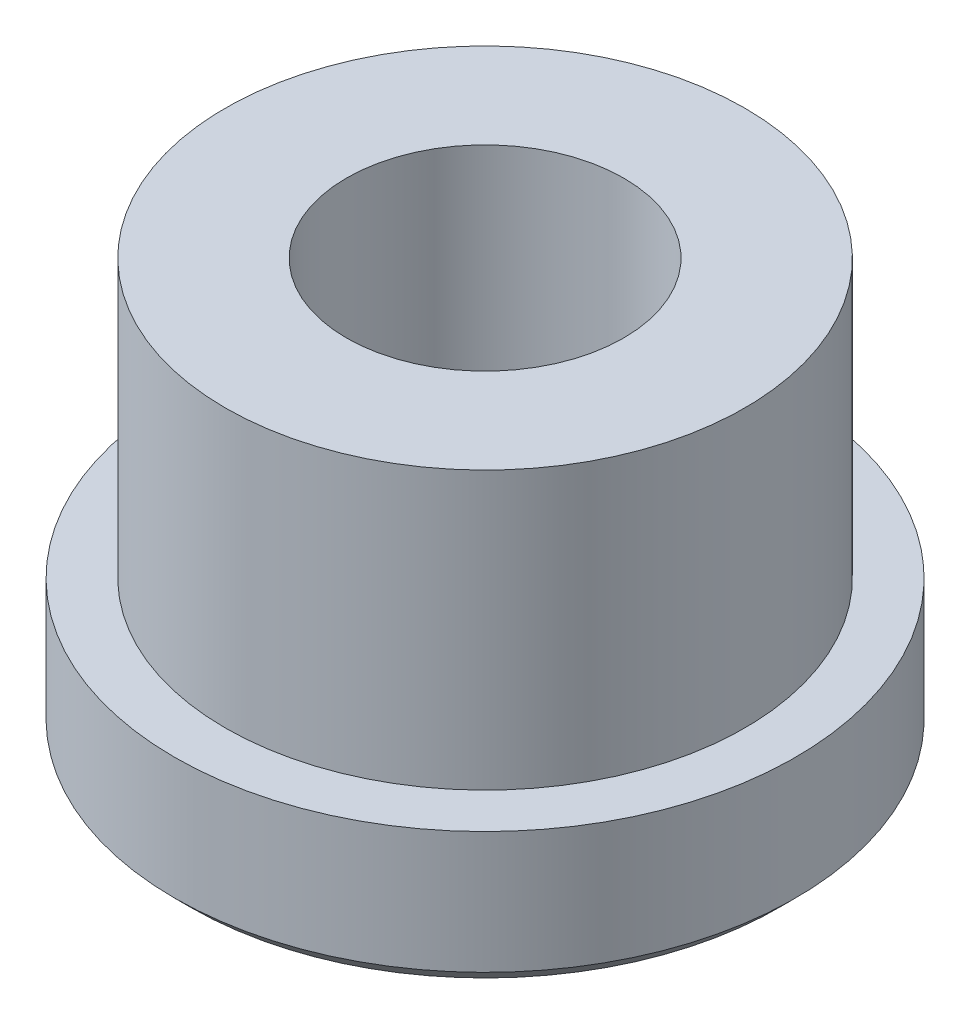
ISO-10303-21;
HEADER;
FILE_DESCRIPTION(('STEP AP214'),'2;1');
FILE_NAME('part.step','',(''),(''),'','','');
FILE_SCHEMA(('AUTOMOTIVE_DESIGN { 1 0 10303 214 1 1 1 1 }'));
ENDSEC;
DATA;
#1=APPLICATION_CONTEXT('core data for automotive mechanical design processes');
#2=APPLICATION_PROTOCOL_DEFINITION('international standard','automotive_design',2000,#1);
#3=PRODUCT_CONTEXT('',#1,'mechanical');
#4=PRODUCT('Part','Part','',(#3));
#5=PRODUCT_RELATED_PRODUCT_CATEGORY('part','',(#4));
#6=PRODUCT_DEFINITION_FORMATION('','',#4);
#7=PRODUCT_DEFINITION_CONTEXT('part definition',#1,'design');
#8=PRODUCT_DEFINITION('design','',#6,#7);
#9=PRODUCT_DEFINITION_SHAPE('','',#8);
#10=(LENGTH_UNIT() NAMED_UNIT(*) SI_UNIT(.MILLI.,.METRE.));
#11=(NAMED_UNIT(*) PLANE_ANGLE_UNIT() SI_UNIT($,.RADIAN.));
#12=(NAMED_UNIT(*) SI_UNIT($,.STERADIAN.) SOLID_ANGLE_UNIT());
#13=UNCERTAINTY_MEASURE_WITH_UNIT(LENGTH_MEASURE(1.E-05),#10,'distance_accuracy_value','');
#14=(GEOMETRIC_REPRESENTATION_CONTEXT(3) GLOBAL_UNCERTAINTY_ASSIGNED_CONTEXT((#13)) GLOBAL_UNIT_ASSIGNED_CONTEXT((#10,
#11,#12)) REPRESENTATION_CONTEXT('',''));
#15=CARTESIAN_POINT('',(0.,0.,0.));
#16=DIRECTION('',(0.,0.,1.));
#17=DIRECTION('',(1.,0.,0.));
#18=AXIS2_PLACEMENT_3D('',#15,#16,#17);
#19=CARTESIAN_POINT('',(6.35,0.,0.));
#20=DIRECTION('',(0.,1.,0.));
#21=DIRECTION('',(0.,0.,1.));
#22=AXIS2_PLACEMENT_3D('',#19,#20,#21);
#23=PLANE('',#22);
#24=CARTESIAN_POINT('',(0.,0.,0.));
#25=DIRECTION('',(0.,1.,0.));
#26=DIRECTION('',(0.,0.,1.));
#27=AXIS2_PLACEMENT_3D('',#24,#25,#26);
#28=CIRCLE('',#27,13.462);
#29=CARTESIAN_POINT('',(0.,0.,13.462));
#30=VERTEX_POINT('',#29);
#31=EDGE_CURVE('E10',#30,#30,#28,.F.);
#32=ORIENTED_EDGE('',*,*,#31,.T.);
#33=EDGE_LOOP('',(#32));
#34=FACE_BOUND('',#33,.T.);
#35=CARTESIAN_POINT('',(0.,0.,0.));
#36=DIRECTION('',(0.,1.,0.));
#37=DIRECTION('',(0.,0.,1.));
#38=AXIS2_PLACEMENT_3D('',#35,#36,#37);
#39=CIRCLE('',#38,6.35);
#40=CARTESIAN_POINT('',(0.,0.,6.35));
#41=VERTEX_POINT('',#40);
#42=EDGE_CURVE('E60',#41,#41,#39,.T.);
#43=ORIENTED_EDGE('',*,*,#42,.T.);
#44=EDGE_LOOP('',(#43));
#45=FACE_BOUND('',#44,.T.);
#46=ADVANCED_FACE('F34',(#34,#45),#23,.F.);
#47=CARTESIAN_POINT('',(0.,0.,0.));
#48=DIRECTION('',(0.,1.,0.));
#49=DIRECTION('',(0.,0.,1.));
#50=AXIS2_PLACEMENT_3D('',#47,#48,#49);
#51=CYLINDRICAL_SURFACE('',#50,14.224);
#52=CARTESIAN_POINT('',(0.,0.762000000000006,0.));
#53=DIRECTION('',(0.,1.,0.));
#54=DIRECTION('',(0.,0.,1.));
#55=AXIS2_PLACEMENT_3D('',#52,#53,#54);
#56=CIRCLE('',#55,14.224);
#57=CARTESIAN_POINT('',(0.,0.762000000000006,14.224));
#58=VERTEX_POINT('',#57);
#59=EDGE_CURVE('E41',#58,#58,#56,.T.);
#60=ORIENTED_EDGE('',*,*,#59,.T.);
#61=EDGE_LOOP('',(#60));
#62=FACE_BOUND('',#61,.T.);
#63=CARTESIAN_POINT('',(0.,6.35,0.));
#64=DIRECTION('',(0.,1.,0.));
#65=DIRECTION('',(0.,0.,1.));
#66=AXIS2_PLACEMENT_3D('',#63,#64,#65);
#67=CIRCLE('',#66,14.224);
#68=CARTESIAN_POINT('',(0.,6.35,14.224));
#69=VERTEX_POINT('',#68);
#70=EDGE_CURVE('E45',#69,#69,#67,.T.);
#71=ORIENTED_EDGE('',*,*,#70,.F.);
#72=EDGE_LOOP('',(#71));
#73=FACE_BOUND('',#72,.T.);
#74=ADVANCED_FACE('F86',(#62,#73),#51,.T.);
#75=CARTESIAN_POINT('',(14.224,6.35,0.));
#76=DIRECTION('',(0.,-1.,0.));
#77=DIRECTION('',(0.,0.,-1.));
#78=AXIS2_PLACEMENT_3D('',#75,#76,#77);
#79=PLANE('',#78);
#80=CARTESIAN_POINT('',(0.,6.35,0.));
#81=DIRECTION('',(0.,1.,0.));
#82=DIRECTION('',(0.,0.,1.));
#83=AXIS2_PLACEMENT_3D('',#80,#81,#82);
#84=CIRCLE('',#83,11.8999);
#85=CARTESIAN_POINT('',(0.,6.35,11.8999));
#86=VERTEX_POINT('',#85);
#87=EDGE_CURVE('E49',#86,#86,#84,.T.);
#88=ORIENTED_EDGE('',*,*,#87,.F.);
#89=EDGE_LOOP('',(#88));
#90=FACE_BOUND('',#89,.T.);
#91=ORIENTED_EDGE('',*,*,#70,.T.);
#92=EDGE_LOOP('',(#91));
#93=FACE_BOUND('',#92,.T.);
#94=ADVANCED_FACE('F80',(#90,#93),#79,.F.);
#95=CARTESIAN_POINT('',(0.,0.,0.));
#96=DIRECTION('',(0.,1.,0.));
#97=DIRECTION('',(0.,0.,1.));
#98=AXIS2_PLACEMENT_3D('',#95,#96,#97);
#99=CYLINDRICAL_SURFACE('',#98,11.8999);
#100=CARTESIAN_POINT('',(0.,19.05,0.));
#101=DIRECTION('',(0.,1.,0.));
#102=DIRECTION('',(0.,0.,1.));
#103=AXIS2_PLACEMENT_3D('',#100,#101,#102);
#104=CIRCLE('',#103,11.8999);
#105=CARTESIAN_POINT('',(0.,19.05,11.8999));
#106=VERTEX_POINT('',#105);
#107=EDGE_CURVE('E54',#106,#106,#104,.T.);
#108=ORIENTED_EDGE('',*,*,#107,.F.);
#109=EDGE_LOOP('',(#108));
#110=FACE_BOUND('',#109,.T.);
#111=ORIENTED_EDGE('',*,*,#87,.T.);
#112=EDGE_LOOP('',(#111));
#113=FACE_BOUND('',#112,.T.);
#114=ADVANCED_FACE('F74',(#110,#113),#99,.T.);
#115=CARTESIAN_POINT('',(11.8999,19.05,0.));
#116=DIRECTION('',(0.,-1.,0.));
#117=DIRECTION('',(0.,0.,-1.));
#118=AXIS2_PLACEMENT_3D('',#115,#116,#117);
#119=PLANE('',#118);
#120=CARTESIAN_POINT('',(0.,19.05,0.));
#121=DIRECTION('',(0.,1.,0.));
#122=DIRECTION('',(0.,0.,1.));
#123=AXIS2_PLACEMENT_3D('',#120,#121,#122);
#124=CIRCLE('',#123,6.35);
#125=CARTESIAN_POINT('',(0.,19.05,6.35));
#126=VERTEX_POINT('',#125);
#127=EDGE_CURVE('E57',#126,#126,#124,.T.);
#128=ORIENTED_EDGE('',*,*,#127,.F.);
#129=EDGE_LOOP('',(#128));
#130=FACE_BOUND('',#129,.T.);
#131=ORIENTED_EDGE('',*,*,#107,.T.);
#132=EDGE_LOOP('',(#131));
#133=FACE_BOUND('',#132,.T.);
#134=ADVANCED_FACE('F68',(#130,#133),#119,.F.);
#135=CARTESIAN_POINT('',(0.,0.,0.));
#136=DIRECTION('',(0.,1.,0.));
#137=DIRECTION('',(0.,0.,1.));
#138=AXIS2_PLACEMENT_3D('',#135,#136,#137);
#139=CYLINDRICAL_SURFACE('',#138,6.35);
#140=ORIENTED_EDGE('',*,*,#42,.F.);
#141=EDGE_LOOP('',(#140));
#142=FACE_BOUND('',#141,.T.);
#143=ORIENTED_EDGE('',*,*,#127,.T.);
#144=EDGE_LOOP('',(#143));
#145=FACE_BOUND('',#144,.T.);
#146=ADVANCED_FACE('F65',(#142,#145),#139,.F.);
#147=CARTESIAN_POINT('',(0.,0.762000000000006,0.));
#148=DIRECTION('',(0.,1.,0.));
#149=DIRECTION('',(0.,0.,1.));
#150=AXIS2_PLACEMENT_3D('',#147,#148,#149);
#151=CONICAL_SURFACE('',#150,14.224,0.78539816339745);
#152=ORIENTED_EDGE('',*,*,#31,.F.);
#153=EDGE_LOOP('',(#152));
#154=FACE_BOUND('',#153,.T.);
#155=ORIENTED_EDGE('',*,*,#59,.F.);
#156=EDGE_LOOP('',(#155));
#157=FACE_BOUND('',#156,.T.);
#158=ADVANCED_FACE('F36',(#154,#157),#151,.T.);
#159=CLOSED_SHELL('',(#46,#74,#94,#114,#134,#146,#158));
#160=MANIFOLD_SOLID_BREP('B2',#159);
#161=ADVANCED_BREP_SHAPE_REPRESENTATION('',(#18,#160),#14);
#162=SHAPE_DEFINITION_REPRESENTATION(#9,#161);
ENDSEC;
END-ISO-10303-21;
